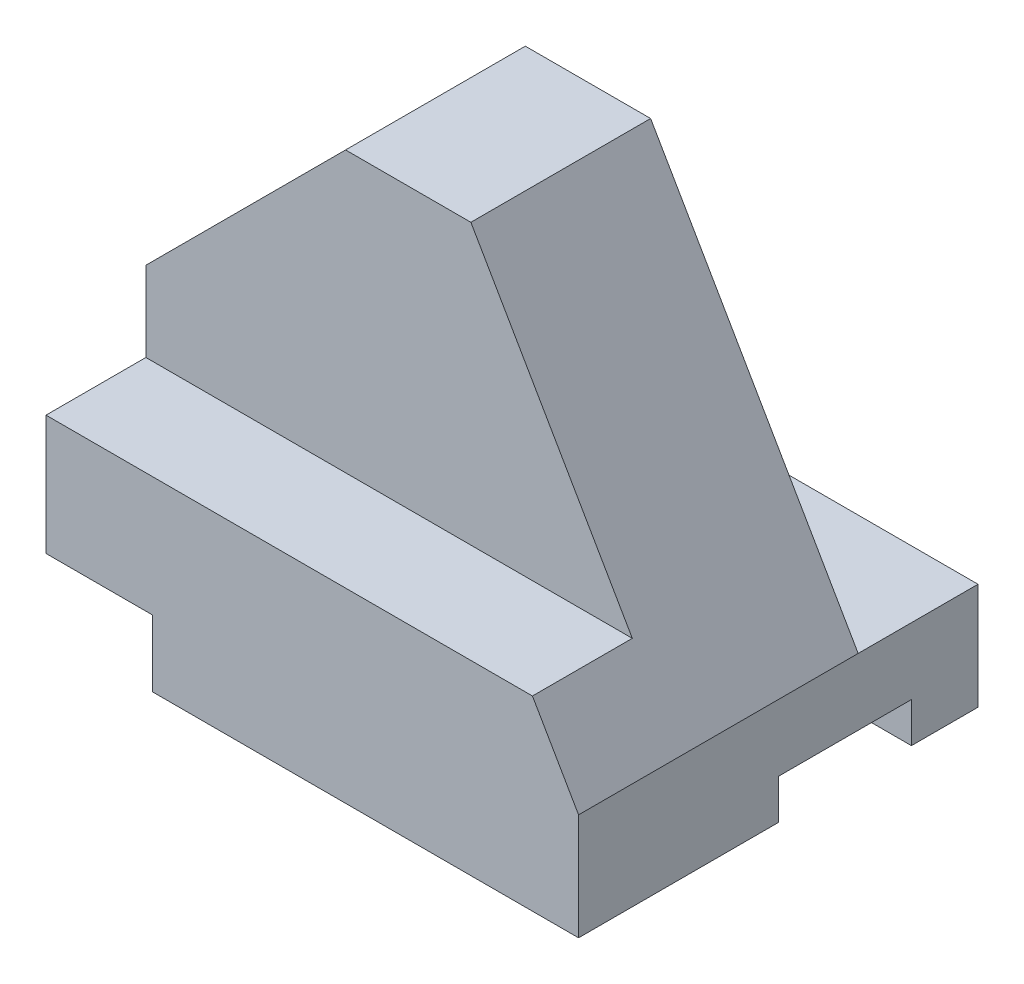
ISO-10303-21;
HEADER;
FILE_DESCRIPTION(('STEP AP214'),'2;1');
FILE_NAME('part.step','',(''),(''),'','','');
FILE_SCHEMA(('AUTOMOTIVE_DESIGN { 1 0 10303 214 1 1 1 1 }'));
ENDSEC;
DATA;
#1=APPLICATION_CONTEXT('core data for automotive mechanical design processes');
#2=APPLICATION_PROTOCOL_DEFINITION('international standard','automotive_design',2000,#1);
#3=PRODUCT_CONTEXT('',#1,'mechanical');
#4=PRODUCT('Part','Part','',(#3));
#5=PRODUCT_RELATED_PRODUCT_CATEGORY('part','',(#4));
#6=PRODUCT_DEFINITION_FORMATION('','',#4);
#7=PRODUCT_DEFINITION_CONTEXT('part definition',#1,'design');
#8=PRODUCT_DEFINITION('design','',#6,#7);
#9=PRODUCT_DEFINITION_SHAPE('','',#8);
#10=(LENGTH_UNIT() NAMED_UNIT(*) SI_UNIT(.MILLI.,.METRE.));
#11=(NAMED_UNIT(*) PLANE_ANGLE_UNIT() SI_UNIT($,.RADIAN.));
#12=(NAMED_UNIT(*) SI_UNIT($,.STERADIAN.) SOLID_ANGLE_UNIT());
#13=UNCERTAINTY_MEASURE_WITH_UNIT(LENGTH_MEASURE(1.E-05),#10,'distance_accuracy_value','');
#14=(GEOMETRIC_REPRESENTATION_CONTEXT(3) GLOBAL_UNCERTAINTY_ASSIGNED_CONTEXT((#13)) GLOBAL_UNIT_ASSIGNED_CONTEXT((#10,
#11,#12)) REPRESENTATION_CONTEXT('',''));
#15=CARTESIAN_POINT('',(0.,0.,0.));
#16=DIRECTION('',(0.,0.,1.));
#17=DIRECTION('',(1.,0.,0.));
#18=AXIS2_PLACEMENT_3D('',#15,#16,#17);
#19=CARTESIAN_POINT('',(-70.,-40.,60.));
#20=DIRECTION('',(0.,1.,0.));
#21=DIRECTION('',(0.,0.,1.));
#22=AXIS2_PLACEMENT_3D('',#19,#20,#21);
#23=PLANE('',#22);
#24=DIRECTION('',(0.,0.,1.));
#25=VECTOR('',#24,1.);
#26=CARTESIAN_POINT('',(-54.,-40.,0.));
#27=LINE('',#26,#25);
#28=CARTESIAN_POINT('',(-54.,-40.,30.));
#29=VERTEX_POINT('',#28);
#30=CARTESIAN_POINT('',(-54.,-40.,60.));
#31=VERTEX_POINT('',#30);
#32=EDGE_CURVE('E502',#29,#31,#27,.T.);
#33=ORIENTED_EDGE('',*,*,#32,.F.);
#34=DIRECTION('',(1.,0.,0.));
#35=VECTOR('',#34,1.);
#36=CARTESIAN_POINT('',(-70.,-40.,30.));
#37=LINE('',#36,#35);
#38=CARTESIAN_POINT('',(10.,-40.,30.));
#39=VERTEX_POINT('',#38);
#40=EDGE_CURVE('E507',#29,#39,#37,.T.);
#41=ORIENTED_EDGE('',*,*,#40,.T.);
#42=DIRECTION('',(0.,0.,-1.));
#43=VECTOR('',#42,1.);
#44=CARTESIAN_POINT('',(10.,-40.,60.));
#45=LINE('',#44,#43);
#46=CARTESIAN_POINT('',(10.,-40.,60.));
#47=VERTEX_POINT('',#46);
#48=EDGE_CURVE('E486',#47,#39,#45,.T.);
#49=ORIENTED_EDGE('',*,*,#48,.F.);
#50=DIRECTION('',(1.,0.,0.));
#51=VECTOR('',#50,1.);
#52=CARTESIAN_POINT('',(-70.,-40.,60.));
#53=LINE('',#52,#51);
#54=EDGE_CURVE('E482',#31,#47,#53,.T.);
#55=ORIENTED_EDGE('',*,*,#54,.F.);
#56=EDGE_LOOP('',(#33,#41,#49,#55));
#57=FACE_BOUND('',#56,.T.);
#58=ADVANCED_FACE('F348',(#57),#23,.F.);
#59=CARTESIAN_POINT('',(-70.,-40.,60.));
#60=DIRECTION('',(1.,0.,0.));
#61=DIRECTION('',(0.,0.,-1.));
#62=AXIS2_PLACEMENT_3D('',#59,#60,#61);
#63=PLANE('',#62);
#64=DIRECTION('',(0.,1.,0.));
#65=VECTOR('',#64,1.);
#66=CARTESIAN_POINT('',(-70.,30.,45.));
#67=LINE('',#66,#65);
#68=CARTESIAN_POINT('',(-70.,-12.,45.));
#69=VERTEX_POINT('',#68);
#70=CARTESIAN_POINT('',(-70.,0.,45.));
#71=VERTEX_POINT('',#70);
#72=EDGE_CURVE('E538',#69,#71,#67,.T.);
#73=ORIENTED_EDGE('',*,*,#72,.T.);
#74=DIRECTION('',(0.,0.,1.));
#75=VECTOR('',#74,1.);
#76=CARTESIAN_POINT('',(-70.,0.,0.));
#77=LINE('',#76,#75);
#78=CARTESIAN_POINT('',(-70.,0.,18.));
#79=VERTEX_POINT('',#78);
#80=EDGE_CURVE('E583',#79,#71,#77,.T.);
#81=ORIENTED_EDGE('',*,*,#80,.F.);
#82=DIRECTION('',(0.,-1.,0.));
#83=VECTOR('',#82,1.);
#84=CARTESIAN_POINT('',(-70.,-24.,18.));
#85=LINE('',#84,#83);
#86=CARTESIAN_POINT('',(-70.,-24.,18.));
#87=VERTEX_POINT('',#86);
#88=EDGE_CURVE('E520',#79,#87,#85,.T.);
#89=ORIENTED_EDGE('',*,*,#88,.T.);
#90=DIRECTION('',(0.,0.,-1.));
#91=VECTOR('',#90,1.);
#92=CARTESIAN_POINT('',(-70.,-24.,0.));
#93=LINE('',#92,#91);
#94=CARTESIAN_POINT('',(-70.,-24.,0.));
#95=VERTEX_POINT('',#94);
#96=EDGE_CURVE('E523',#87,#95,#93,.T.);
#97=ORIENTED_EDGE('',*,*,#96,.T.);
#98=DIRECTION('',(0.,-1.,0.));
#99=VECTOR('',#98,1.);
#100=CARTESIAN_POINT('',(-70.,-40.,0.));
#101=LINE('',#100,#99);
#102=CARTESIAN_POINT('',(-70.,-30.,0.));
#103=VERTEX_POINT('',#102);
#104=EDGE_CURVE('E545',#95,#103,#101,.T.);
#105=ORIENTED_EDGE('',*,*,#104,.T.);
#106=DIRECTION('',(0.,0.,1.));
#107=VECTOR('',#106,1.);
#108=CARTESIAN_POINT('',(-70.,-30.,0.));
#109=LINE('',#108,#107);
#110=CARTESIAN_POINT('',(-70.,-30.,60.));
#111=VERTEX_POINT('',#110);
#112=EDGE_CURVE('E521',#103,#111,#109,.T.);
#113=ORIENTED_EDGE('',*,*,#112,.T.);
#114=DIRECTION('',(0.,-1.,0.));
#115=VECTOR('',#114,1.);
#116=CARTESIAN_POINT('',(-70.,-40.,60.));
#117=LINE('',#116,#115);
#118=CARTESIAN_POINT('',(-70.,-12.,60.));
#119=VERTEX_POINT('',#118);
#120=EDGE_CURVE('E488',#119,#111,#117,.T.);
#121=ORIENTED_EDGE('',*,*,#120,.F.);
#122=DIRECTION('',(0.,0.,-1.));
#123=VECTOR('',#122,1.);
#124=CARTESIAN_POINT('',(-70.,-12.,45.));
#125=LINE('',#124,#123);
#126=EDGE_CURVE('E530',#119,#69,#125,.T.);
#127=ORIENTED_EDGE('',*,*,#126,.T.);
#128=EDGE_LOOP('',(#73,#81,#89,#97,#105,#113,#121,#127));
#129=FACE_BOUND('',#128,.T.);
#130=ADVANCED_FACE('F350',(#129),#63,.F.);
#131=CARTESIAN_POINT('',(10.,-40.,10.));
#132=VERTEX_POINT('',#131);
#133=CARTESIAN_POINT('',(10.,-40.,0.));
#134=VERTEX_POINT('',#133);
#135=EDGE_CURVE('E484',#132,#134,#45,.T.);
#136=ORIENTED_EDGE('',*,*,#135,.F.);
#137=DIRECTION('',(1.,0.,0.));
#138=VECTOR('',#137,1.);
#139=CARTESIAN_POINT('',(-70.,-40.,10.));
#140=LINE('',#139,#138);
#141=CARTESIAN_POINT('',(-54.,-40.,10.));
#142=VERTEX_POINT('',#141);
#143=EDGE_CURVE('E570',#142,#132,#140,.T.);
#144=ORIENTED_EDGE('',*,*,#143,.F.);
#145=CARTESIAN_POINT('',(-54.,-40.,0.));
#146=VERTEX_POINT('',#145);
#147=EDGE_CURVE('E508',#146,#142,#27,.T.);
#148=ORIENTED_EDGE('',*,*,#147,.F.);
#149=DIRECTION('',(1.,0.,0.));
#150=VECTOR('',#149,1.);
#151=CARTESIAN_POINT('',(-70.,-40.,0.));
#152=LINE('',#151,#150);
#153=EDGE_CURVE('E552',#146,#134,#152,.T.);
#154=ORIENTED_EDGE('',*,*,#153,.T.);
#155=EDGE_LOOP('',(#136,#144,#148,#154));
#156=FACE_BOUND('',#155,.T.);
#157=ADVANCED_FACE('F621',(#156),#23,.F.);
#158=CARTESIAN_POINT('',(10.,30.,60.));
#159=DIRECTION('',(-1.,0.,0.));
#160=DIRECTION('',(0.,0.,1.));
#161=AXIS2_PLACEMENT_3D('',#158,#159,#160);
#162=PLANE('',#161);
#163=DIRECTION('',(0.,0.,-1.));
#164=VECTOR('',#163,1.);
#165=CARTESIAN_POINT('',(10.,-24.,0.));
#166=LINE('',#165,#164);
#167=CARTESIAN_POINT('',(10.,-24.,18.));
#168=VERTEX_POINT('',#167);
#169=CARTESIAN_POINT('',(10.,-24.,0.));
#170=VERTEX_POINT('',#169);
#171=EDGE_CURVE('E476',#168,#170,#166,.T.);
#172=ORIENTED_EDGE('',*,*,#171,.F.);
#173=DIRECTION('',(0.,0.,1.));
#174=VECTOR('',#173,1.);
#175=CARTESIAN_POINT('',(10.,-24.,0.));
#176=LINE('',#175,#174);
#177=CARTESIAN_POINT('',(10.,-24.,60.));
#178=VERTEX_POINT('',#177);
#179=EDGE_CURVE('E459',#168,#178,#176,.T.);
#180=ORIENTED_EDGE('',*,*,#179,.T.);
#181=DIRECTION('',(0.,1.,0.));
#182=VECTOR('',#181,1.);
#183=CARTESIAN_POINT('',(10.,30.,60.));
#184=LINE('',#183,#182);
#185=EDGE_CURVE('E474',#47,#178,#184,.T.);
#186=ORIENTED_EDGE('',*,*,#185,.F.);
#187=ORIENTED_EDGE('',*,*,#48,.T.);
#188=DIRECTION('',(0.,-1.,0.));
#189=VECTOR('',#188,1.);
#190=CARTESIAN_POINT('',(10.,-40.,30.));
#191=LINE('',#190,#189);
#192=CARTESIAN_POINT('',(10.,-34.,30.));
#193=VERTEX_POINT('',#192);
#194=EDGE_CURVE('E572',#193,#39,#191,.T.);
#195=ORIENTED_EDGE('',*,*,#194,.F.);
#196=DIRECTION('',(0.,0.,1.));
#197=VECTOR('',#196,1.);
#198=CARTESIAN_POINT('',(10.,-34.,30.));
#199=LINE('',#198,#197);
#200=CARTESIAN_POINT('',(10.,-34.,10.));
#201=VERTEX_POINT('',#200);
#202=EDGE_CURVE('E578',#201,#193,#199,.T.);
#203=ORIENTED_EDGE('',*,*,#202,.F.);
#204=DIRECTION('',(0.,1.,0.));
#205=VECTOR('',#204,1.);
#206=CARTESIAN_POINT('',(10.,-34.,10.));
#207=LINE('',#206,#205);
#208=EDGE_CURVE('E581',#132,#201,#207,.T.);
#209=ORIENTED_EDGE('',*,*,#208,.F.);
#210=ORIENTED_EDGE('',*,*,#135,.T.);
#211=DIRECTION('',(0.,1.,0.));
#212=VECTOR('',#211,1.);
#213=CARTESIAN_POINT('',(10.,30.,0.));
#214=LINE('',#213,#212);
#215=EDGE_CURVE('E555',#134,#170,#214,.T.);
#216=ORIENTED_EDGE('',*,*,#215,.T.);
#217=EDGE_LOOP('',(#172,#180,#186,#187,#195,#203,#209,#210,#216));
#218=FACE_BOUND('',#217,.T.);
#219=ADVANCED_FACE('F472',(#218),#162,.F.);
#220=CARTESIAN_POINT('',(-70.,30.,60.));
#221=DIRECTION('',(0.,-1.,0.));
#222=DIRECTION('',(0.,0.,-1.));
#223=AXIS2_PLACEMENT_3D('',#220,#221,#222);
#224=PLANE('',#223);
#225=DIRECTION('',(1.,0.,0.));
#226=VECTOR('',#225,1.);
#227=CARTESIAN_POINT('',(-70.,30.,45.));
#228=LINE('',#227,#226);
#229=CARTESIAN_POINT('',(-40.,30.,45.));
#230=VERTEX_POINT('',#229);
#231=CARTESIAN_POINT('',(-21.1769145362394,30.,45.));
#232=VERTEX_POINT('',#231);
#233=EDGE_CURVE('E542',#230,#232,#228,.T.);
#234=ORIENTED_EDGE('',*,*,#233,.T.);
#235=DIRECTION('',(0.,0.,1.));
#236=VECTOR('',#235,1.);
#237=CARTESIAN_POINT('',(-21.1769145362394,30.,0.));
#238=LINE('',#237,#236);
#239=CARTESIAN_POINT('',(-21.1769145362394,30.,18.));
#240=VERTEX_POINT('',#239);
#241=EDGE_CURVE('E467',#240,#232,#238,.T.);
#242=ORIENTED_EDGE('',*,*,#241,.F.);
#243=DIRECTION('',(1.,0.,0.));
#244=VECTOR('',#243,1.);
#245=CARTESIAN_POINT('',(-70.,30.,18.));
#246=LINE('',#245,#244);
#247=CARTESIAN_POINT('',(-40.,30.,18.));
#248=VERTEX_POINT('',#247);
#249=EDGE_CURVE('E527',#248,#240,#246,.T.);
#250=ORIENTED_EDGE('',*,*,#249,.F.);
#251=DIRECTION('',(0.,0.,1.));
#252=VECTOR('',#251,1.);
#253=CARTESIAN_POINT('',(-40.,30.,0.));
#254=LINE('',#253,#252);
#255=EDGE_CURVE('E363',#248,#230,#254,.T.);
#256=ORIENTED_EDGE('',*,*,#255,.T.);
#257=EDGE_LOOP('',(#234,#242,#250,#256));
#258=FACE_BOUND('',#257,.T.);
#259=ADVANCED_FACE('F601',(#258),#224,.F.);
#260=CARTESIAN_POINT('',(-70.,30.,60.));
#261=DIRECTION('',(0.,0.,-1.));
#262=DIRECTION('',(-1.,0.,0.));
#263=AXIS2_PLACEMENT_3D('',#260,#261,#262);
#264=PLANE('',#263);
#265=ORIENTED_EDGE('',*,*,#185,.T.);
#266=DIRECTION('',(0.499999999999995,-0.866025403784441,0.));
#267=VECTOR('',#266,1.);
#268=CARTESIAN_POINT('',(10.,-24.,60.));
#269=LINE('',#268,#267);
#270=CARTESIAN_POINT('',(3.07179676972458,-12.,60.));
#271=VERTEX_POINT('',#270);
#272=EDGE_CURVE('E456',#271,#178,#269,.T.);
#273=ORIENTED_EDGE('',*,*,#272,.F.);
#274=DIRECTION('',(1.,0.,0.));
#275=VECTOR('',#274,1.);
#276=CARTESIAN_POINT('',(-70.,-12.,60.));
#277=LINE('',#276,#275);
#278=EDGE_CURVE('E541',#119,#271,#277,.T.);
#279=ORIENTED_EDGE('',*,*,#278,.F.);
#280=ORIENTED_EDGE('',*,*,#120,.T.);
#281=DIRECTION('',(-1.,0.,0.));
#282=VECTOR('',#281,1.);
#283=CARTESIAN_POINT('',(-54.,-30.,60.));
#284=LINE('',#283,#282);
#285=CARTESIAN_POINT('',(-54.,-30.,60.));
#286=VERTEX_POINT('',#285);
#287=EDGE_CURVE('E559',#286,#111,#284,.T.);
#288=ORIENTED_EDGE('',*,*,#287,.F.);
#289=DIRECTION('',(0.,1.,0.));
#290=VECTOR('',#289,1.);
#291=CARTESIAN_POINT('',(-54.,-40.,60.));
#292=LINE('',#291,#290);
#293=EDGE_CURVE('E568',#31,#286,#292,.T.);
#294=ORIENTED_EDGE('',*,*,#293,.F.);
#295=ORIENTED_EDGE('',*,*,#54,.T.);
#296=EDGE_LOOP('',(#265,#273,#279,#280,#288,#294,#295));
#297=FACE_BOUND('',#296,.T.);
#298=ADVANCED_FACE('F479',(#297),#264,.F.);
#299=CARTESIAN_POINT('',(-70.,30.,0.));
#300=DIRECTION('',(0.,0.,-1.));
#301=DIRECTION('',(-1.,0.,0.));
#302=AXIS2_PLACEMENT_3D('',#299,#300,#301);
#303=PLANE('',#302);
#304=DIRECTION('',(-1.,0.,0.));
#305=VECTOR('',#304,1.);
#306=CARTESIAN_POINT('',(-54.,-30.,0.));
#307=LINE('',#306,#305);
#308=CARTESIAN_POINT('',(-54.,-30.,0.));
#309=VERTEX_POINT('',#308);
#310=EDGE_CURVE('E509',#309,#103,#307,.T.);
#311=ORIENTED_EDGE('',*,*,#310,.T.);
#312=ORIENTED_EDGE('',*,*,#104,.F.);
#313=DIRECTION('',(1.,0.,0.));
#314=VECTOR('',#313,1.);
#315=CARTESIAN_POINT('',(-70.,-24.,0.));
#316=LINE('',#315,#314);
#317=EDGE_CURVE('E531',#95,#170,#316,.T.);
#318=ORIENTED_EDGE('',*,*,#317,.T.);
#319=ORIENTED_EDGE('',*,*,#215,.F.);
#320=ORIENTED_EDGE('',*,*,#153,.F.);
#321=DIRECTION('',(0.,1.,0.));
#322=VECTOR('',#321,1.);
#323=CARTESIAN_POINT('',(-54.,-40.,0.));
#324=LINE('',#323,#322);
#325=EDGE_CURVE('E514',#146,#309,#324,.T.);
#326=ORIENTED_EDGE('',*,*,#325,.T.);
#327=EDGE_LOOP('',(#311,#312,#318,#319,#320,#326));
#328=FACE_BOUND('',#327,.T.);
#329=ADVANCED_FACE('F613',(#328),#303,.T.);
#330=CARTESIAN_POINT('',(-70.,30.,45.));
#331=DIRECTION('',(0.,0.,-1.));
#332=DIRECTION('',(0.,1.,0.));
#333=AXIS2_PLACEMENT_3D('',#330,#331,#332);
#334=PLANE('',#333);
#335=DIRECTION('',(1.,0.,0.));
#336=VECTOR('',#335,1.);
#337=CARTESIAN_POINT('',(-70.,-12.,45.));
#338=LINE('',#337,#336);
#339=CARTESIAN_POINT('',(3.07179676972458,-12.,45.));
#340=VERTEX_POINT('',#339);
#341=EDGE_CURVE('E546',#69,#340,#338,.T.);
#342=ORIENTED_EDGE('',*,*,#341,.T.);
#343=DIRECTION('',(-0.499999999999995,0.866025403784442,0.));
#344=VECTOR('',#343,1.);
#345=CARTESIAN_POINT('',(-33.3826859021793,51.1410161513776,45.));
#346=LINE('',#345,#344);
#347=EDGE_CURVE('E588',#340,#232,#346,.T.);
#348=ORIENTED_EDGE('',*,*,#347,.T.);
#349=ORIENTED_EDGE('',*,*,#233,.F.);
#350=DIRECTION('',(0.707106781186548,0.707106781186547,0.));
#351=VECTOR('',#350,1.);
#352=CARTESIAN_POINT('',(-40.,30.,45.));
#353=LINE('',#352,#351);
#354=EDGE_CURVE('E585',#71,#230,#353,.T.);
#355=ORIENTED_EDGE('',*,*,#354,.F.);
#356=ORIENTED_EDGE('',*,*,#72,.F.);
#357=EDGE_LOOP('',(#342,#348,#349,#355,#356));
#358=FACE_BOUND('',#357,.T.);
#359=ADVANCED_FACE('F598',(#358),#334,.F.);
#360=CARTESIAN_POINT('',(-70.,-12.,45.));
#361=DIRECTION('',(0.,-1.,0.));
#362=DIRECTION('',(0.,0.,-1.));
#363=AXIS2_PLACEMENT_3D('',#360,#361,#362);
#364=PLANE('',#363);
#365=ORIENTED_EDGE('',*,*,#278,.T.);
#366=DIRECTION('',(0.,0.,-1.));
#367=VECTOR('',#366,1.);
#368=CARTESIAN_POINT('',(3.07179676972458,-12.,45.));
#369=LINE('',#368,#367);
#370=EDGE_CURVE('E462',#271,#340,#369,.T.);
#371=ORIENTED_EDGE('',*,*,#370,.T.);
#372=ORIENTED_EDGE('',*,*,#341,.F.);
#373=ORIENTED_EDGE('',*,*,#126,.F.);
#374=EDGE_LOOP('',(#365,#371,#372,#373));
#375=FACE_BOUND('',#374,.T.);
#376=ADVANCED_FACE('F652',(#375),#364,.F.);
#377=CARTESIAN_POINT('',(-70.,-24.,18.));
#378=DIRECTION('',(0.,0.,1.));
#379=DIRECTION('',(0.,-1.,0.));
#380=AXIS2_PLACEMENT_3D('',#377,#378,#379);
#381=PLANE('',#380);
#382=ORIENTED_EDGE('',*,*,#249,.T.);
#383=DIRECTION('',(0.499999999999995,-0.866025403784442,0.));
#384=VECTOR('',#383,1.);
#385=CARTESIAN_POINT('',(-9.9999999999996,10.6410161513773,18.));
#386=LINE('',#385,#384);
#387=EDGE_CURVE('E477',#240,#168,#386,.T.);
#388=ORIENTED_EDGE('',*,*,#387,.T.);
#389=DIRECTION('',(1.,0.,0.));
#390=VECTOR('',#389,1.);
#391=CARTESIAN_POINT('',(-70.,-24.,18.));
#392=LINE('',#391,#390);
#393=EDGE_CURVE('E526',#87,#168,#392,.T.);
#394=ORIENTED_EDGE('',*,*,#393,.F.);
#395=ORIENTED_EDGE('',*,*,#88,.F.);
#396=DIRECTION('',(0.707106781186548,0.707106781186547,0.));
#397=VECTOR('',#396,1.);
#398=CARTESIAN_POINT('',(-82.,-12.,18.));
#399=LINE('',#398,#397);
#400=EDGE_CURVE('E11',#79,#248,#399,.T.);
#401=ORIENTED_EDGE('',*,*,#400,.T.);
#402=EDGE_LOOP('',(#382,#388,#394,#395,#401));
#403=FACE_BOUND('',#402,.T.);
#404=ADVANCED_FACE('F603',(#403),#381,.F.);
#405=CARTESIAN_POINT('',(-70.,-24.,0.));
#406=DIRECTION('',(0.,-1.,0.));
#407=DIRECTION('',(0.,0.,-1.));
#408=AXIS2_PLACEMENT_3D('',#405,#406,#407);
#409=PLANE('',#408);
#410=ORIENTED_EDGE('',*,*,#171,.T.);
#411=ORIENTED_EDGE('',*,*,#317,.F.);
#412=ORIENTED_EDGE('',*,*,#96,.F.);
#413=ORIENTED_EDGE('',*,*,#393,.T.);
#414=EDGE_LOOP('',(#410,#411,#412,#413));
#415=FACE_BOUND('',#414,.T.);
#416=ADVANCED_FACE('F610',(#415),#409,.F.);
#417=CARTESIAN_POINT('',(-54.,-30.,0.));
#418=DIRECTION('',(0.,1.,0.));
#419=DIRECTION('',(0.,0.,1.));
#420=AXIS2_PLACEMENT_3D('',#417,#418,#419);
#421=PLANE('',#420);
#422=ORIENTED_EDGE('',*,*,#287,.T.);
#423=ORIENTED_EDGE('',*,*,#112,.F.);
#424=ORIENTED_EDGE('',*,*,#310,.F.);
#425=DIRECTION('',(0.,0.,1.));
#426=VECTOR('',#425,1.);
#427=CARTESIAN_POINT('',(-54.,-30.,0.));
#428=LINE('',#427,#426);
#429=EDGE_CURVE('E512',#309,#286,#428,.T.);
#430=ORIENTED_EDGE('',*,*,#429,.T.);
#431=EDGE_LOOP('',(#422,#423,#424,#430));
#432=FACE_BOUND('',#431,.T.);
#433=ADVANCED_FACE('F623',(#432),#421,.F.);
#434=CARTESIAN_POINT('',(-54.,-40.,0.));
#435=DIRECTION('',(1.,0.,0.));
#436=DIRECTION('',(0.,0.,-1.));
#437=AXIS2_PLACEMENT_3D('',#434,#435,#436);
#438=PLANE('',#437);
#439=DIRECTION('',(0.,0.,1.));
#440=VECTOR('',#439,1.);
#441=CARTESIAN_POINT('',(-54.,-34.,0.));
#442=LINE('',#441,#440);
#443=CARTESIAN_POINT('',(-54.,-34.,10.));
#444=VERTEX_POINT('',#443);
#445=CARTESIAN_POINT('',(-54.,-34.,30.));
#446=VERTEX_POINT('',#445);
#447=EDGE_CURVE('E495',#444,#446,#442,.T.);
#448=ORIENTED_EDGE('',*,*,#447,.T.);
#449=DIRECTION('',(0.,-1.,0.));
#450=VECTOR('',#449,1.);
#451=CARTESIAN_POINT('',(-54.,-40.,30.));
#452=LINE('',#451,#450);
#453=EDGE_CURVE('E356',#446,#29,#452,.T.);
#454=ORIENTED_EDGE('',*,*,#453,.T.);
#455=ORIENTED_EDGE('',*,*,#32,.T.);
#456=ORIENTED_EDGE('',*,*,#293,.T.);
#457=ORIENTED_EDGE('',*,*,#429,.F.);
#458=ORIENTED_EDGE('',*,*,#325,.F.);
#459=ORIENTED_EDGE('',*,*,#147,.T.);
#460=DIRECTION('',(0.,1.,0.));
#461=VECTOR('',#460,1.);
#462=CARTESIAN_POINT('',(-54.,-40.,10.));
#463=LINE('',#462,#461);
#464=EDGE_CURVE('E492',#142,#444,#463,.T.);
#465=ORIENTED_EDGE('',*,*,#464,.T.);
#466=EDGE_LOOP('',(#448,#454,#455,#456,#457,#458,#459,#465));
#467=FACE_BOUND('',#466,.T.);
#468=ADVANCED_FACE('F500',(#467),#438,.F.);
#469=CARTESIAN_POINT('',(-70.,-40.,30.));
#470=DIRECTION('',(0.,0.,1.));
#471=DIRECTION('',(1.,0.,0.));
#472=AXIS2_PLACEMENT_3D('',#469,#470,#471);
#473=PLANE('',#472);
#474=DIRECTION('',(1.,0.,0.));
#475=VECTOR('',#474,1.);
#476=CARTESIAN_POINT('',(-70.,-34.,30.));
#477=LINE('',#476,#475);
#478=EDGE_CURVE('E574',#446,#193,#477,.T.);
#479=ORIENTED_EDGE('',*,*,#478,.T.);
#480=ORIENTED_EDGE('',*,*,#194,.T.);
#481=ORIENTED_EDGE('',*,*,#40,.F.);
#482=ORIENTED_EDGE('',*,*,#453,.F.);
#483=EDGE_LOOP('',(#479,#480,#481,#482));
#484=FACE_BOUND('',#483,.T.);
#485=ADVANCED_FACE('F630',(#484),#473,.F.);
#486=CARTESIAN_POINT('',(-70.,-34.,30.));
#487=DIRECTION('',(0.,1.,0.));
#488=DIRECTION('',(0.,0.,1.));
#489=AXIS2_PLACEMENT_3D('',#486,#487,#488);
#490=PLANE('',#489);
#491=DIRECTION('',(1.,0.,0.));
#492=VECTOR('',#491,1.);
#493=CARTESIAN_POINT('',(-70.,-34.,10.));
#494=LINE('',#493,#492);
#495=EDGE_CURVE('E370',#444,#201,#494,.T.);
#496=ORIENTED_EDGE('',*,*,#495,.T.);
#497=ORIENTED_EDGE('',*,*,#202,.T.);
#498=ORIENTED_EDGE('',*,*,#478,.F.);
#499=ORIENTED_EDGE('',*,*,#447,.F.);
#500=EDGE_LOOP('',(#496,#497,#498,#499));
#501=FACE_BOUND('',#500,.T.);
#502=ADVANCED_FACE('F682',(#501),#490,.F.);
#503=CARTESIAN_POINT('',(-70.,-34.,10.));
#504=DIRECTION('',(0.,0.,-1.));
#505=DIRECTION('',(-1.,0.,0.));
#506=AXIS2_PLACEMENT_3D('',#503,#504,#505);
#507=PLANE('',#506);
#508=ORIENTED_EDGE('',*,*,#143,.T.);
#509=ORIENTED_EDGE('',*,*,#208,.T.);
#510=ORIENTED_EDGE('',*,*,#495,.F.);
#511=ORIENTED_EDGE('',*,*,#464,.F.);
#512=EDGE_LOOP('',(#508,#509,#510,#511));
#513=FACE_BOUND('',#512,.T.);
#514=ADVANCED_FACE('F689',(#513),#507,.F.);
#515=CARTESIAN_POINT('',(-40.,30.,0.));
#516=DIRECTION('',(0.707106781186547,-0.707106781186548,0.));
#517=DIRECTION('',(0.707106781186548,0.707106781186547,0.));
#518=AXIS2_PLACEMENT_3D('',#515,#516,#517);
#519=PLANE('',#518);
#520=ORIENTED_EDGE('',*,*,#80,.T.);
#521=ORIENTED_EDGE('',*,*,#354,.T.);
#522=ORIENTED_EDGE('',*,*,#255,.F.);
#523=ORIENTED_EDGE('',*,*,#400,.F.);
#524=EDGE_LOOP('',(#520,#521,#522,#523));
#525=FACE_BOUND('',#524,.T.);
#526=ADVANCED_FACE('F607',(#525),#519,.F.);
#527=CARTESIAN_POINT('',(10.,-24.,0.));
#528=DIRECTION('',(-0.866025403784441,-0.499999999999995,0.));
#529=DIRECTION('',(0.499999999999995,-0.866025403784442,0.));
#530=AXIS2_PLACEMENT_3D('',#527,#528,#529);
#531=PLANE('',#530);
#532=ORIENTED_EDGE('',*,*,#370,.F.);
#533=ORIENTED_EDGE('',*,*,#272,.T.);
#534=ORIENTED_EDGE('',*,*,#179,.F.);
#535=ORIENTED_EDGE('',*,*,#387,.F.);
#536=ORIENTED_EDGE('',*,*,#241,.T.);
#537=ORIENTED_EDGE('',*,*,#347,.F.);
#538=EDGE_LOOP('',(#532,#533,#534,#535,#536,#537));
#539=FACE_BOUND('',#538,.T.);
#540=ADVANCED_FACE('F458',(#539),#531,.F.);
#541=CLOSED_SHELL('',(#58,#130,#157,#219,#259,#298,#329,#359,#376,#404,#416,#433,#468,#485,#502,
#514,#526,#540));
#542=MANIFOLD_SOLID_BREP('B2',#541);
#543=ADVANCED_BREP_SHAPE_REPRESENTATION('',(#18,#542),#14);
#544=SHAPE_DEFINITION_REPRESENTATION(#9,#543);
ENDSEC;
END-ISO-10303-21;
